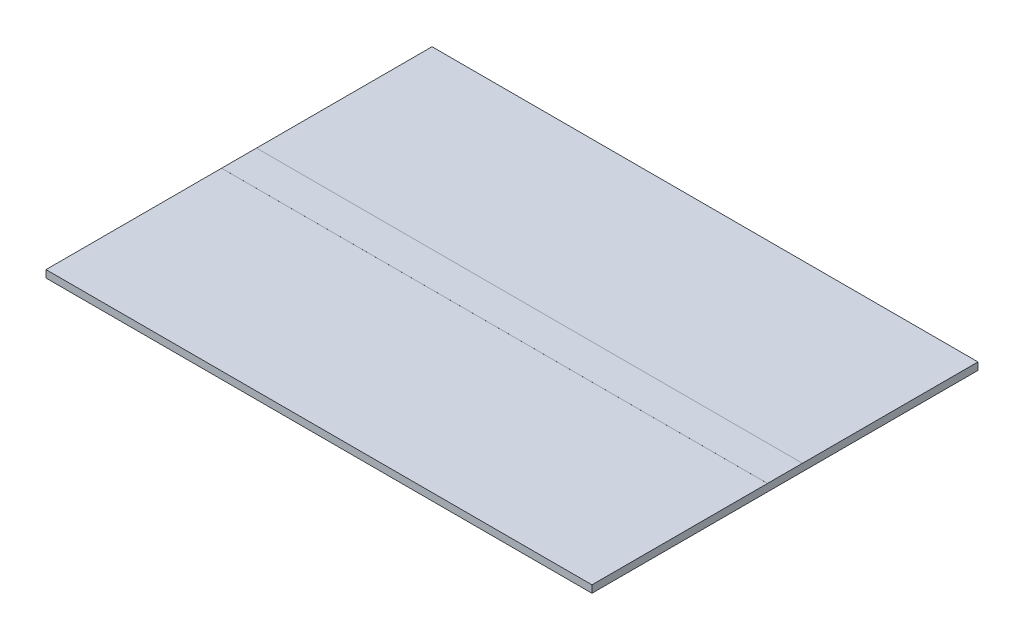
ISO-10303-21;
HEADER;
FILE_DESCRIPTION(('STEP AP214'),'2;1');
FILE_NAME('part.step','',(''),(''),'','','');
FILE_SCHEMA(('AUTOMOTIVE_DESIGN { 1 0 10303 214 1 1 1 1 }'));
ENDSEC;
DATA;
#1=APPLICATION_CONTEXT('core data for automotive mechanical design processes');
#2=APPLICATION_PROTOCOL_DEFINITION('international standard','automotive_design',2000,#1);
#3=PRODUCT_CONTEXT('',#1,'mechanical');
#4=PRODUCT('Part','Part','',(#3));
#5=PRODUCT_RELATED_PRODUCT_CATEGORY('part','',(#4));
#6=PRODUCT_DEFINITION_FORMATION('','',#4);
#7=PRODUCT_DEFINITION_CONTEXT('part definition',#1,'design');
#8=PRODUCT_DEFINITION('design','',#6,#7);
#9=PRODUCT_DEFINITION_SHAPE('','',#8);
#10=(LENGTH_UNIT() NAMED_UNIT(*) SI_UNIT(.MILLI.,.METRE.));
#11=(NAMED_UNIT(*) PLANE_ANGLE_UNIT() SI_UNIT($,.RADIAN.));
#12=(NAMED_UNIT(*) SI_UNIT($,.STERADIAN.) SOLID_ANGLE_UNIT());
#13=UNCERTAINTY_MEASURE_WITH_UNIT(LENGTH_MEASURE(1.E-05),#10,'distance_accuracy_value','');
#14=(GEOMETRIC_REPRESENTATION_CONTEXT(3) GLOBAL_UNCERTAINTY_ASSIGNED_CONTEXT((#13)) GLOBAL_UNIT_ASSIGNED_CONTEXT((#10,
#11,#12)) REPRESENTATION_CONTEXT('',''));
#15=CARTESIAN_POINT('',(0.,0.,0.));
#16=DIRECTION('',(0.,0.,1.));
#17=DIRECTION('',(1.,0.,0.));
#18=AXIS2_PLACEMENT_3D('',#15,#16,#17);
#19=CARTESIAN_POINT('',(0.,4.,0.));
#20=DIRECTION('',(0.,1.,0.));
#21=DIRECTION('',(0.,0.,1.));
#22=AXIS2_PLACEMENT_3D('',#19,#20,#21);
#23=PLANE('',#22);
#24=DIRECTION('',(-1.,0.,0.));
#25=VECTOR('',#24,1.);
#26=CARTESIAN_POINT('',(-127.365869017632,4.,24.242443324937));
#27=LINE('',#26,#25);
#28=CARTESIAN_POINT('',(169.634130982368,4.,24.242443324937));
#29=VERTEX_POINT('',#28);
#30=CARTESIAN_POINT('',(-127.365869017632,4.,24.242443324937));
#31=VERTEX_POINT('',#30);
#32=EDGE_CURVE('E51',#29,#31,#27,.T.);
#33=ORIENTED_EDGE('',*,*,#32,.F.);
#34=DIRECTION('',(0.,0.,-1.));
#35=VECTOR('',#34,1.);
#36=CARTESIAN_POINT('',(169.634130982368,4.,-71.257556675063));
#37=LINE('',#36,#35);
#38=CARTESIAN_POINT('',(169.634130982368,4.,-71.257556675063));
#39=VERTEX_POINT('',#38);
#40=EDGE_CURVE('E136',#29,#39,#37,.T.);
#41=ORIENTED_EDGE('',*,*,#40,.T.);
#42=DIRECTION('',(-1.,0.,0.));
#43=VECTOR('',#42,1.);
#44=CARTESIAN_POINT('',(-127.365869017632,4.,-71.257556675063));
#45=LINE('',#44,#43);
#46=CARTESIAN_POINT('',(-127.365869017632,4.,-71.257556675063));
#47=VERTEX_POINT('',#46);
#48=EDGE_CURVE('E139',#39,#47,#45,.T.);
#49=ORIENTED_EDGE('',*,*,#48,.T.);
#50=DIRECTION('',(0.,0.,1.));
#51=VECTOR('',#50,1.);
#52=CARTESIAN_POINT('',(-127.365869017632,4.,-71.257556675063));
#53=LINE('',#52,#51);
#54=EDGE_CURVE('E132',#47,#31,#53,.T.);
#55=ORIENTED_EDGE('',*,*,#54,.T.);
#56=EDGE_LOOP('',(#33,#41,#49,#55));
#57=FACE_BOUND('',#56,.T.);
#58=ADVANCED_FACE('F36',(#57),#23,.T.);
#59=CARTESIAN_POINT('',(-127.365869017632,4.,-71.257556675063));
#60=DIRECTION('',(1.,0.,0.));
#61=DIRECTION('',(0.,0.,-1.));
#62=AXIS2_PLACEMENT_3D('',#59,#60,#61);
#63=PLANE('',#62);
#64=DIRECTION('',(0.,0.,1.));
#65=VECTOR('',#64,1.);
#66=CARTESIAN_POINT('',(-127.365869017632,0.,-71.257556675063));
#67=LINE('',#66,#65);
#68=CARTESIAN_POINT('',(-127.365869017632,0.,-71.257556675063));
#69=VERTEX_POINT('',#68);
#70=CARTESIAN_POINT('',(-127.365869017632,0.,138.742443324937));
#71=VERTEX_POINT('',#70);
#72=EDGE_CURVE('E124',#69,#71,#67,.T.);
#73=ORIENTED_EDGE('',*,*,#72,.T.);
#74=DIRECTION('',(0.,-1.,0.));
#75=VECTOR('',#74,1.);
#76=CARTESIAN_POINT('',(-127.365869017632,4.,138.742443324937));
#77=LINE('',#76,#75);
#78=CARTESIAN_POINT('',(-127.365869017632,4.,138.742443324937));
#79=VERTEX_POINT('',#78);
#80=EDGE_CURVE('E11',#79,#71,#77,.T.);
#81=ORIENTED_EDGE('',*,*,#80,.F.);
#82=CARTESIAN_POINT('',(-127.365869017632,4.,43.242443324937));
#83=VERTEX_POINT('',#82);
#84=EDGE_CURVE('E123',#83,#79,#53,.T.);
#85=ORIENTED_EDGE('',*,*,#84,.F.);
#86=DIRECTION('',(0.,-1.,0.));
#87=VECTOR('',#86,1.);
#88=CARTESIAN_POINT('',(-127.365869017632,4.01,43.242443324937));
#89=LINE('',#88,#87);
#90=CARTESIAN_POINT('',(-127.365869017632,4.01,43.242443324937));
#91=VERTEX_POINT('',#90);
#92=EDGE_CURVE('E105',#91,#83,#89,.T.);
#93=ORIENTED_EDGE('',*,*,#92,.F.);
#94=DIRECTION('',(0.,0.,1.));
#95=VECTOR('',#94,1.);
#96=CARTESIAN_POINT('',(-127.365869017632,4.01,24.242443324937));
#97=LINE('',#96,#95);
#98=CARTESIAN_POINT('',(-127.365869017632,4.01,24.242443324937));
#99=VERTEX_POINT('',#98);
#100=EDGE_CURVE('E111',#99,#91,#97,.T.);
#101=ORIENTED_EDGE('',*,*,#100,.F.);
#102=DIRECTION('',(0.,-1.,0.));
#103=VECTOR('',#102,1.);
#104=CARTESIAN_POINT('',(-127.365869017632,4.01,24.242443324937));
#105=LINE('',#104,#103);
#106=EDGE_CURVE('E169',#99,#31,#105,.T.);
#107=ORIENTED_EDGE('',*,*,#106,.T.);
#108=ORIENTED_EDGE('',*,*,#54,.F.);
#109=DIRECTION('',(0.,-1.,0.));
#110=VECTOR('',#109,1.);
#111=CARTESIAN_POINT('',(-127.365869017632,4.,-71.257556675063));
#112=LINE('',#111,#110);
#113=EDGE_CURVE('E140',#47,#69,#112,.T.);
#114=ORIENTED_EDGE('',*,*,#113,.T.);
#115=EDGE_LOOP('',(#73,#81,#85,#93,#101,#107,#108,#114));
#116=FACE_BOUND('',#115,.T.);
#117=ADVANCED_FACE('F38',(#116),#63,.F.);
#118=CARTESIAN_POINT('',(-127.365869017632,4.,138.742443324937));
#119=DIRECTION('',(0.,0.,-1.));
#120=DIRECTION('',(-1.,0.,0.));
#121=AXIS2_PLACEMENT_3D('',#118,#119,#120);
#122=PLANE('',#121);
#123=DIRECTION('',(1.,0.,0.));
#124=VECTOR('',#123,1.);
#125=CARTESIAN_POINT('',(-127.365869017632,0.,138.742443324937));
#126=LINE('',#125,#124);
#127=CARTESIAN_POINT('',(169.634130982368,0.,138.742443324937));
#128=VERTEX_POINT('',#127);
#129=EDGE_CURVE('E126',#71,#128,#126,.T.);
#130=ORIENTED_EDGE('',*,*,#129,.T.);
#131=DIRECTION('',(0.,-1.,0.));
#132=VECTOR('',#131,1.);
#133=CARTESIAN_POINT('',(169.634130982368,4.,138.742443324937));
#134=LINE('',#133,#132);
#135=CARTESIAN_POINT('',(169.634130982368,4.,138.742443324937));
#136=VERTEX_POINT('',#135);
#137=EDGE_CURVE('E44',#136,#128,#134,.T.);
#138=ORIENTED_EDGE('',*,*,#137,.F.);
#139=DIRECTION('',(1.,0.,0.));
#140=VECTOR('',#139,1.);
#141=CARTESIAN_POINT('',(-127.365869017632,4.,138.742443324937));
#142=LINE('',#141,#140);
#143=EDGE_CURVE('E134',#79,#136,#142,.T.);
#144=ORIENTED_EDGE('',*,*,#143,.F.);
#145=ORIENTED_EDGE('',*,*,#80,.T.);
#146=EDGE_LOOP('',(#130,#138,#144,#145));
#147=FACE_BOUND('',#146,.T.);
#148=ADVANCED_FACE('F193',(#147),#122,.F.);
#149=CARTESIAN_POINT('',(169.634130982368,4.,-71.257556675063));
#150=DIRECTION('',(-1.,0.,0.));
#151=DIRECTION('',(0.,0.,1.));
#152=AXIS2_PLACEMENT_3D('',#149,#150,#151);
#153=PLANE('',#152);
#154=DIRECTION('',(0.,0.,-1.));
#155=VECTOR('',#154,1.);
#156=CARTESIAN_POINT('',(169.634130982368,0.,-71.257556675063));
#157=LINE('',#156,#155);
#158=CARTESIAN_POINT('',(169.634130982368,0.,-71.257556675063));
#159=VERTEX_POINT('',#158);
#160=EDGE_CURVE('E143',#128,#159,#157,.T.);
#161=ORIENTED_EDGE('',*,*,#160,.T.);
#162=DIRECTION('',(0.,-1.,0.));
#163=VECTOR('',#162,1.);
#164=CARTESIAN_POINT('',(169.634130982368,4.,-71.257556675063));
#165=LINE('',#164,#163);
#166=EDGE_CURVE('E149',#39,#159,#165,.T.);
#167=ORIENTED_EDGE('',*,*,#166,.F.);
#168=ORIENTED_EDGE('',*,*,#40,.F.);
#169=DIRECTION('',(0.,-1.,0.));
#170=VECTOR('',#169,1.);
#171=CARTESIAN_POINT('',(169.634130982368,4.01,24.242443324937));
#172=LINE('',#171,#170);
#173=CARTESIAN_POINT('',(169.634130982368,4.01,24.242443324937));
#174=VERTEX_POINT('',#173);
#175=EDGE_CURVE('E128',#174,#29,#172,.T.);
#176=ORIENTED_EDGE('',*,*,#175,.F.);
#177=DIRECTION('',(0.,0.,-1.));
#178=VECTOR('',#177,1.);
#179=CARTESIAN_POINT('',(169.634130982368,4.01,24.242443324937));
#180=LINE('',#179,#178);
#181=CARTESIAN_POINT('',(169.634130982368,4.01,43.242443324937));
#182=VERTEX_POINT('',#181);
#183=EDGE_CURVE('E110',#182,#174,#180,.T.);
#184=ORIENTED_EDGE('',*,*,#183,.F.);
#185=DIRECTION('',(0.,-1.,0.));
#186=VECTOR('',#185,1.);
#187=CARTESIAN_POINT('',(169.634130982368,4.01,43.242443324937));
#188=LINE('',#187,#186);
#189=CARTESIAN_POINT('',(169.634130982368,4.,43.242443324937));
#190=VERTEX_POINT('',#189);
#191=EDGE_CURVE('E107',#182,#190,#188,.T.);
#192=ORIENTED_EDGE('',*,*,#191,.T.);
#193=EDGE_CURVE('E137',#136,#190,#37,.T.);
#194=ORIENTED_EDGE('',*,*,#193,.F.);
#195=ORIENTED_EDGE('',*,*,#137,.T.);
#196=EDGE_LOOP('',(#161,#167,#168,#176,#184,#192,#194,#195));
#197=FACE_BOUND('',#196,.T.);
#198=ADVANCED_FACE('F156',(#197),#153,.F.);
#199=CARTESIAN_POINT('',(-127.365869017632,4.,-71.257556675063));
#200=DIRECTION('',(0.,0.,1.));
#201=DIRECTION('',(1.,0.,0.));
#202=AXIS2_PLACEMENT_3D('',#199,#200,#201);
#203=PLANE('',#202);
#204=DIRECTION('',(-1.,0.,0.));
#205=VECTOR('',#204,1.);
#206=CARTESIAN_POINT('',(-127.365869017632,0.,-71.257556675063));
#207=LINE('',#206,#205);
#208=EDGE_CURVE('E145',#159,#69,#207,.T.);
#209=ORIENTED_EDGE('',*,*,#208,.T.);
#210=ORIENTED_EDGE('',*,*,#113,.F.);
#211=ORIENTED_EDGE('',*,*,#48,.F.);
#212=ORIENTED_EDGE('',*,*,#166,.T.);
#213=EDGE_LOOP('',(#209,#210,#211,#212));
#214=FACE_BOUND('',#213,.T.);
#215=ADVANCED_FACE('F166',(#214),#203,.F.);
#216=DIRECTION('',(1.,0.,0.));
#217=VECTOR('',#216,1.);
#218=CARTESIAN_POINT('',(-127.365869017632,4.,43.242443324937));
#219=LINE('',#218,#217);
#220=EDGE_CURVE('E59',#83,#190,#219,.T.);
#221=ORIENTED_EDGE('',*,*,#220,.F.);
#222=ORIENTED_EDGE('',*,*,#84,.T.);
#223=ORIENTED_EDGE('',*,*,#143,.T.);
#224=ORIENTED_EDGE('',*,*,#193,.T.);
#225=EDGE_LOOP('',(#221,#222,#223,#224));
#226=FACE_BOUND('',#225,.T.);
#227=ADVANCED_FACE('F189',(#226),#23,.T.);
#228=CARTESIAN_POINT('',(0.,0.,0.));
#229=DIRECTION('',(0.,1.,0.));
#230=DIRECTION('',(0.,0.,1.));
#231=AXIS2_PLACEMENT_3D('',#228,#229,#230);
#232=PLANE('',#231);
#233=ORIENTED_EDGE('',*,*,#72,.F.);
#234=ORIENTED_EDGE('',*,*,#208,.F.);
#235=ORIENTED_EDGE('',*,*,#160,.F.);
#236=ORIENTED_EDGE('',*,*,#129,.F.);
#237=EDGE_LOOP('',(#233,#234,#235,#236));
#238=FACE_BOUND('',#237,.T.);
#239=ADVANCED_FACE('F163',(#238),#232,.F.);
#240=CARTESIAN_POINT('',(-127.365869017632,4.01,43.242443324937));
#241=DIRECTION('',(0.,0.,-1.));
#242=DIRECTION('',(-1.,0.,0.));
#243=AXIS2_PLACEMENT_3D('',#240,#241,#242);
#244=PLANE('',#243);
#245=ORIENTED_EDGE('',*,*,#220,.T.);
#246=ORIENTED_EDGE('',*,*,#191,.F.);
#247=DIRECTION('',(1.,0.,0.));
#248=VECTOR('',#247,1.);
#249=CARTESIAN_POINT('',(-127.365869017632,4.01,43.242443324937));
#250=LINE('',#249,#248);
#251=EDGE_CURVE('E101',#91,#182,#250,.T.);
#252=ORIENTED_EDGE('',*,*,#251,.F.);
#253=ORIENTED_EDGE('',*,*,#92,.T.);
#254=EDGE_LOOP('',(#245,#246,#252,#253));
#255=FACE_BOUND('',#254,.T.);
#256=ADVANCED_FACE('F103',(#255),#244,.F.);
#257=CARTESIAN_POINT('',(-127.365869017632,4.01,24.242443324937));
#258=DIRECTION('',(0.,0.,1.));
#259=DIRECTION('',(1.,0.,0.));
#260=AXIS2_PLACEMENT_3D('',#257,#258,#259);
#261=PLANE('',#260);
#262=ORIENTED_EDGE('',*,*,#32,.T.);
#263=ORIENTED_EDGE('',*,*,#106,.F.);
#264=DIRECTION('',(-1.,0.,0.));
#265=VECTOR('',#264,1.);
#266=CARTESIAN_POINT('',(-127.365869017632,4.01,24.242443324937));
#267=LINE('',#266,#265);
#268=EDGE_CURVE('E116',#174,#99,#267,.T.);
#269=ORIENTED_EDGE('',*,*,#268,.F.);
#270=ORIENTED_EDGE('',*,*,#175,.T.);
#271=EDGE_LOOP('',(#262,#263,#269,#270));
#272=FACE_BOUND('',#271,.T.);
#273=ADVANCED_FACE('F172',(#272),#261,.F.);
#274=CARTESIAN_POINT('',(0.,4.01,0.));
#275=DIRECTION('',(0.,1.,0.));
#276=DIRECTION('',(0.,0.,1.));
#277=AXIS2_PLACEMENT_3D('',#274,#275,#276);
#278=PLANE('',#277);
#279=ORIENTED_EDGE('',*,*,#100,.T.);
#280=ORIENTED_EDGE('',*,*,#251,.T.);
#281=ORIENTED_EDGE('',*,*,#183,.T.);
#282=ORIENTED_EDGE('',*,*,#268,.T.);
#283=EDGE_LOOP('',(#279,#280,#281,#282));
#284=FACE_BOUND('',#283,.T.);
#285=ADVANCED_FACE('F114',(#284),#278,.T.);
#286=CLOSED_SHELL('',(#58,#117,#148,#198,#215,#227,#239,#256,#273,#285));
#287=MANIFOLD_SOLID_BREP('B2',#286);
#288=ADVANCED_BREP_SHAPE_REPRESENTATION('',(#18,#287),#14);
#289=SHAPE_DEFINITION_REPRESENTATION(#9,#288);
ENDSEC;
END-ISO-10303-21;
